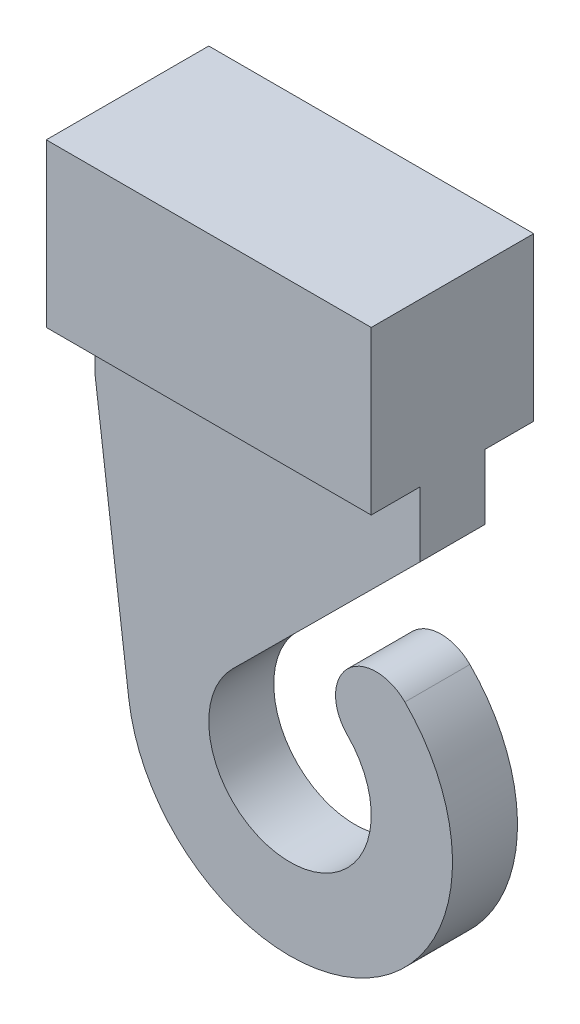
ISO-10303-21;
HEADER;
FILE_DESCRIPTION(('STEP AP214'),'2;1');
FILE_NAME('part.step','',(''),(''),'','','');
FILE_SCHEMA(('AUTOMOTIVE_DESIGN { 1 0 10303 214 1 1 1 1 }'));
ENDSEC;
DATA;
#1=APPLICATION_CONTEXT('core data for automotive mechanical design processes');
#2=APPLICATION_PROTOCOL_DEFINITION('international standard','automotive_design',2000,#1);
#3=PRODUCT_CONTEXT('',#1,'mechanical');
#4=PRODUCT('Part','Part','',(#3));
#5=PRODUCT_RELATED_PRODUCT_CATEGORY('part','',(#4));
#6=PRODUCT_DEFINITION_FORMATION('','',#4);
#7=PRODUCT_DEFINITION_CONTEXT('part definition',#1,'design');
#8=PRODUCT_DEFINITION('design','',#6,#7);
#9=PRODUCT_DEFINITION_SHAPE('','',#8);
#10=(LENGTH_UNIT() NAMED_UNIT(*) SI_UNIT(.MILLI.,.METRE.));
#11=(NAMED_UNIT(*) PLANE_ANGLE_UNIT() SI_UNIT($,.RADIAN.));
#12=(NAMED_UNIT(*) SI_UNIT($,.STERADIAN.) SOLID_ANGLE_UNIT());
#13=UNCERTAINTY_MEASURE_WITH_UNIT(LENGTH_MEASURE(1.E-05),#10,'distance_accuracy_value','');
#14=(GEOMETRIC_REPRESENTATION_CONTEXT(3) GLOBAL_UNCERTAINTY_ASSIGNED_CONTEXT((#13)) GLOBAL_UNIT_ASSIGNED_CONTEXT((#10,
#11,#12)) REPRESENTATION_CONTEXT('',''));
#15=CARTESIAN_POINT('',(0.,0.,0.));
#16=DIRECTION('',(0.,0.,1.));
#17=DIRECTION('',(1.,0.,0.));
#18=AXIS2_PLACEMENT_3D('',#15,#16,#17);
#19=CARTESIAN_POINT('',(8.,-2.5,2.5));
#20=DIRECTION('',(0.,1.,0.));
#21=DIRECTION('',(0.,0.,1.));
#22=AXIS2_PLACEMENT_3D('',#19,#20,#21);
#23=PLANE('',#22);
#24=DIRECTION('',(1.,0.,0.));
#25=VECTOR('',#24,1.);
#26=CARTESIAN_POINT('',(0.,-2.5,-1.));
#27=LINE('',#26,#25);
#28=CARTESIAN_POINT('',(0.,-2.5,-1.));
#29=VERTEX_POINT('',#28);
#30=CARTESIAN_POINT('',(10.,-2.5,-1.));
#31=VERTEX_POINT('',#30);
#32=EDGE_CURVE('E207',#29,#31,#27,.T.);
#33=ORIENTED_EDGE('',*,*,#32,.F.);
#34=DIRECTION('',(0.,0.,-1.));
#35=VECTOR('',#34,1.);
#36=CARTESIAN_POINT('',(0.,-2.5,2.5));
#37=LINE('',#36,#35);
#38=CARTESIAN_POINT('',(0.,-2.5,-2.5));
#39=VERTEX_POINT('',#38);
#40=EDGE_CURVE('E276',#29,#39,#37,.T.);
#41=ORIENTED_EDGE('',*,*,#40,.T.);
#42=DIRECTION('',(-1.,0.,0.));
#43=VECTOR('',#42,1.);
#44=CARTESIAN_POINT('',(8.,-2.5,-2.5));
#45=LINE('',#44,#43);
#46=CARTESIAN_POINT('',(10.,-2.5,-2.5));
#47=VERTEX_POINT('',#46);
#48=EDGE_CURVE('E279',#47,#39,#45,.T.);
#49=ORIENTED_EDGE('',*,*,#48,.F.);
#50=DIRECTION('',(0.,0.,-1.));
#51=VECTOR('',#50,1.);
#52=CARTESIAN_POINT('',(10.,-2.5,2.5));
#53=LINE('',#52,#51);
#54=EDGE_CURVE('E55',#31,#47,#53,.T.);
#55=ORIENTED_EDGE('',*,*,#54,.F.);
#56=EDGE_LOOP('',(#33,#41,#49,#55));
#57=FACE_BOUND('',#56,.T.);
#58=ADVANCED_FACE('F40',(#57),#23,.F.);
#59=DIRECTION('',(-1.,0.,0.));
#60=VECTOR('',#59,1.);
#61=CARTESIAN_POINT('',(0.,-2.5,0.999999999999998));
#62=LINE('',#61,#60);
#63=CARTESIAN_POINT('',(10.,-2.5,0.999999999999998));
#64=VERTEX_POINT('',#63);
#65=CARTESIAN_POINT('',(0.,-2.5,0.999999999999998));
#66=VERTEX_POINT('',#65);
#67=EDGE_CURVE('E63',#64,#66,#62,.T.);
#68=ORIENTED_EDGE('',*,*,#67,.F.);
#69=CARTESIAN_POINT('',(10.,-2.5,2.5));
#70=VERTEX_POINT('',#69);
#71=EDGE_CURVE('E224',#70,#64,#53,.T.);
#72=ORIENTED_EDGE('',*,*,#71,.F.);
#73=DIRECTION('',(-1.,0.,0.));
#74=VECTOR('',#73,1.);
#75=CARTESIAN_POINT('',(8.,-2.5,2.5));
#76=LINE('',#75,#74);
#77=CARTESIAN_POINT('',(0.,-2.5,2.5));
#78=VERTEX_POINT('',#77);
#79=EDGE_CURVE('E282',#70,#78,#76,.T.);
#80=ORIENTED_EDGE('',*,*,#79,.T.);
#81=EDGE_CURVE('E277',#78,#66,#37,.T.);
#82=ORIENTED_EDGE('',*,*,#81,.T.);
#83=EDGE_LOOP('',(#68,#72,#80,#82));
#84=FACE_BOUND('',#83,.T.);
#85=ADVANCED_FACE('F297',(#84),#23,.F.);
#86=CARTESIAN_POINT('',(0.,0.,0.));
#87=DIRECTION('',(1.,0.,0.));
#88=DIRECTION('',(0.,0.,-1.));
#89=AXIS2_PLACEMENT_3D('',#86,#87,#88);
#90=PLANE('',#89);
#91=DIRECTION('',(0.,1.,0.));
#92=VECTOR('',#91,1.);
#93=CARTESIAN_POINT('',(0.,2.5,-2.5));
#94=LINE('',#93,#92);
#95=CARTESIAN_POINT('',(0.,2.5,-2.5));
#96=VERTEX_POINT('',#95);
#97=EDGE_CURVE('E269',#39,#96,#94,.T.);
#98=ORIENTED_EDGE('',*,*,#97,.F.);
#99=ORIENTED_EDGE('',*,*,#40,.F.);
#100=DIRECTION('',(0.,1.,0.));
#101=VECTOR('',#100,1.);
#102=CARTESIAN_POINT('',(0.,-4.5,-1.));
#103=LINE('',#102,#101);
#104=CARTESIAN_POINT('',(0.,-4.5,-1.));
#105=VERTEX_POINT('',#104);
#106=EDGE_CURVE('E215',#105,#29,#103,.T.);
#107=ORIENTED_EDGE('',*,*,#106,.F.);
#108=DIRECTION('',(0.,0.,-1.));
#109=VECTOR('',#108,1.);
#110=CARTESIAN_POINT('',(0.,-4.5,0.999999999999998));
#111=LINE('',#110,#109);
#112=CARTESIAN_POINT('',(0.,-4.5,0.999999999999998));
#113=VERTEX_POINT('',#112);
#114=EDGE_CURVE('E206',#113,#105,#111,.T.);
#115=ORIENTED_EDGE('',*,*,#114,.F.);
#116=DIRECTION('',(0.,1.,0.));
#117=VECTOR('',#116,1.);
#118=CARTESIAN_POINT('',(0.,-4.5,0.999999999999998));
#119=LINE('',#118,#117);
#120=EDGE_CURVE('E218',#113,#66,#119,.T.);
#121=ORIENTED_EDGE('',*,*,#120,.T.);
#122=ORIENTED_EDGE('',*,*,#81,.F.);
#123=DIRECTION('',(0.,-1.,0.));
#124=VECTOR('',#123,1.);
#125=CARTESIAN_POINT('',(0.,2.5,2.5));
#126=LINE('',#125,#124);
#127=CARTESIAN_POINT('',(0.,2.5,2.5));
#128=VERTEX_POINT('',#127);
#129=EDGE_CURVE('E274',#128,#78,#126,.T.);
#130=ORIENTED_EDGE('',*,*,#129,.F.);
#131=DIRECTION('',(0.,0.,1.));
#132=VECTOR('',#131,1.);
#133=CARTESIAN_POINT('',(0.,2.5,2.5));
#134=LINE('',#133,#132);
#135=EDGE_CURVE('E272',#96,#128,#134,.T.);
#136=ORIENTED_EDGE('',*,*,#135,.F.);
#137=EDGE_LOOP('',(#98,#99,#107,#115,#121,#122,#130,#136));
#138=FACE_BOUND('',#137,.T.);
#139=DIRECTION('',(0.,1.,0.));
#140=VECTOR('',#139,1.);
#141=CARTESIAN_POINT('',(0.,1.5,-1.5));
#142=LINE('',#141,#140);
#143=CARTESIAN_POINT('',(0.,-1.5,-1.5));
#144=VERTEX_POINT('',#143);
#145=CARTESIAN_POINT('',(0.,1.5,-1.5));
#146=VERTEX_POINT('',#145);
#147=EDGE_CURVE('E235',#144,#146,#142,.T.);
#148=ORIENTED_EDGE('',*,*,#147,.T.);
#149=DIRECTION('',(0.,0.,1.));
#150=VECTOR('',#149,1.);
#151=CARTESIAN_POINT('',(0.,1.5,1.5));
#152=LINE('',#151,#150);
#153=CARTESIAN_POINT('',(0.,1.5,1.5));
#154=VERTEX_POINT('',#153);
#155=EDGE_CURVE('E252',#146,#154,#152,.T.);
#156=ORIENTED_EDGE('',*,*,#155,.T.);
#157=DIRECTION('',(0.,-1.,0.));
#158=VECTOR('',#157,1.);
#159=CARTESIAN_POINT('',(0.,1.5,1.5));
#160=LINE('',#159,#158);
#161=CARTESIAN_POINT('',(0.,-1.5,1.5));
#162=VERTEX_POINT('',#161);
#163=EDGE_CURVE('E255',#154,#162,#160,.T.);
#164=ORIENTED_EDGE('',*,*,#163,.T.);
#165=DIRECTION('',(0.,0.,-1.));
#166=VECTOR('',#165,1.);
#167=CARTESIAN_POINT('',(0.,-1.5,1.5));
#168=LINE('',#167,#166);
#169=EDGE_CURVE('E240',#162,#144,#168,.T.);
#170=ORIENTED_EDGE('',*,*,#169,.T.);
#171=EDGE_LOOP('',(#148,#156,#164,#170));
#172=FACE_BOUND('',#171,.T.);
#173=ADVANCED_FACE('F294',(#138,#172),#90,.F.);
#174=CARTESIAN_POINT('',(8.,2.5,-2.5));
#175=DIRECTION('',(0.,0.,1.));
#176=DIRECTION('',(0.,-1.,0.));
#177=AXIS2_PLACEMENT_3D('',#174,#175,#176);
#178=PLANE('',#177);
#179=ORIENTED_EDGE('',*,*,#97,.T.);
#180=DIRECTION('',(-1.,0.,0.));
#181=VECTOR('',#180,1.);
#182=CARTESIAN_POINT('',(8.,2.5,-2.5));
#183=LINE('',#182,#181);
#184=CARTESIAN_POINT('',(10.,2.5,-2.5));
#185=VERTEX_POINT('',#184);
#186=EDGE_CURVE('E11',#185,#96,#183,.T.);
#187=ORIENTED_EDGE('',*,*,#186,.F.);
#188=DIRECTION('',(0.,1.,0.));
#189=VECTOR('',#188,1.);
#190=CARTESIAN_POINT('',(10.,-2.5,-2.5));
#191=LINE('',#190,#189);
#192=EDGE_CURVE('E226',#47,#185,#191,.T.);
#193=ORIENTED_EDGE('',*,*,#192,.F.);
#194=ORIENTED_EDGE('',*,*,#48,.T.);
#195=EDGE_LOOP('',(#179,#187,#193,#194));
#196=FACE_BOUND('',#195,.T.);
#197=ADVANCED_FACE('F42',(#196),#178,.F.);
#198=CARTESIAN_POINT('',(8.,2.5,2.5));
#199=DIRECTION('',(0.,-1.,0.));
#200=DIRECTION('',(0.,0.,-1.));
#201=AXIS2_PLACEMENT_3D('',#198,#199,#200);
#202=PLANE('',#201);
#203=ORIENTED_EDGE('',*,*,#135,.T.);
#204=DIRECTION('',(-1.,0.,0.));
#205=VECTOR('',#204,1.);
#206=CARTESIAN_POINT('',(8.,2.5,2.5));
#207=LINE('',#206,#205);
#208=CARTESIAN_POINT('',(10.,2.5,2.5));
#209=VERTEX_POINT('',#208);
#210=EDGE_CURVE('E48',#209,#128,#207,.T.);
#211=ORIENTED_EDGE('',*,*,#210,.F.);
#212=DIRECTION('',(0.,0.,1.));
#213=VECTOR('',#212,1.);
#214=CARTESIAN_POINT('',(10.,2.5,-2.5));
#215=LINE('',#214,#213);
#216=EDGE_CURVE('E229',#185,#209,#215,.T.);
#217=ORIENTED_EDGE('',*,*,#216,.F.);
#218=ORIENTED_EDGE('',*,*,#186,.T.);
#219=EDGE_LOOP('',(#203,#211,#217,#218));
#220=FACE_BOUND('',#219,.T.);
#221=ADVANCED_FACE('F315',(#220),#202,.F.);
#222=CARTESIAN_POINT('',(8.,2.5,2.5));
#223=DIRECTION('',(0.,0.,-1.));
#224=DIRECTION('',(0.,1.,0.));
#225=AXIS2_PLACEMENT_3D('',#222,#223,#224);
#226=PLANE('',#225);
#227=ORIENTED_EDGE('',*,*,#129,.T.);
#228=ORIENTED_EDGE('',*,*,#79,.F.);
#229=DIRECTION('',(0.,-1.,0.));
#230=VECTOR('',#229,1.);
#231=CARTESIAN_POINT('',(10.,2.5,2.5));
#232=LINE('',#231,#230);
#233=EDGE_CURVE('E232',#209,#70,#232,.T.);
#234=ORIENTED_EDGE('',*,*,#233,.F.);
#235=ORIENTED_EDGE('',*,*,#210,.T.);
#236=EDGE_LOOP('',(#227,#228,#234,#235));
#237=FACE_BOUND('',#236,.T.);
#238=ADVANCED_FACE('F288',(#237),#226,.F.);
#239=CARTESIAN_POINT('',(8.,1.5,-1.5));
#240=DIRECTION('',(0.,0.,1.));
#241=DIRECTION('',(0.,-1.,0.));
#242=AXIS2_PLACEMENT_3D('',#239,#240,#241);
#243=PLANE('',#242);
#244=ORIENTED_EDGE('',*,*,#147,.F.);
#245=DIRECTION('',(-1.,0.,0.));
#246=VECTOR('',#245,1.);
#247=CARTESIAN_POINT('',(8.,-1.5,-1.5));
#248=LINE('',#247,#246);
#249=CARTESIAN_POINT('',(8.,-1.5,-1.5));
#250=VERTEX_POINT('',#249);
#251=EDGE_CURVE('E249',#250,#144,#248,.T.);
#252=ORIENTED_EDGE('',*,*,#251,.F.);
#253=DIRECTION('',(0.,1.,0.));
#254=VECTOR('',#253,1.);
#255=CARTESIAN_POINT('',(8.,1.5,-1.5));
#256=LINE('',#255,#254);
#257=CARTESIAN_POINT('',(8.,1.5,-1.5));
#258=VERTEX_POINT('',#257);
#259=EDGE_CURVE('E236',#250,#258,#256,.T.);
#260=ORIENTED_EDGE('',*,*,#259,.T.);
#261=DIRECTION('',(-1.,0.,0.));
#262=VECTOR('',#261,1.);
#263=CARTESIAN_POINT('',(8.,1.5,-1.5));
#264=LINE('',#263,#262);
#265=EDGE_CURVE('E266',#258,#146,#264,.T.);
#266=ORIENTED_EDGE('',*,*,#265,.T.);
#267=EDGE_LOOP('',(#244,#252,#260,#266));
#268=FACE_BOUND('',#267,.T.);
#269=ADVANCED_FACE('F321',(#268),#243,.T.);
#270=CARTESIAN_POINT('',(8.,1.5,1.5));
#271=DIRECTION('',(0.,-1.,0.));
#272=DIRECTION('',(0.,0.,-1.));
#273=AXIS2_PLACEMENT_3D('',#270,#271,#272);
#274=PLANE('',#273);
#275=ORIENTED_EDGE('',*,*,#155,.F.);
#276=ORIENTED_EDGE('',*,*,#265,.F.);
#277=DIRECTION('',(0.,0.,1.));
#278=VECTOR('',#277,1.);
#279=CARTESIAN_POINT('',(8.,1.5,1.5));
#280=LINE('',#279,#278);
#281=CARTESIAN_POINT('',(8.,1.5,1.5));
#282=VERTEX_POINT('',#281);
#283=EDGE_CURVE('E239',#258,#282,#280,.T.);
#284=ORIENTED_EDGE('',*,*,#283,.T.);
#285=DIRECTION('',(-1.,0.,0.));
#286=VECTOR('',#285,1.);
#287=CARTESIAN_POINT('',(8.,1.5,1.5));
#288=LINE('',#287,#286);
#289=EDGE_CURVE('E264',#282,#154,#288,.T.);
#290=ORIENTED_EDGE('',*,*,#289,.T.);
#291=EDGE_LOOP('',(#275,#276,#284,#290));
#292=FACE_BOUND('',#291,.T.);
#293=ADVANCED_FACE('F333',(#292),#274,.T.);
#294=CARTESIAN_POINT('',(8.,1.5,1.5));
#295=DIRECTION('',(0.,0.,-1.));
#296=DIRECTION('',(0.,1.,0.));
#297=AXIS2_PLACEMENT_3D('',#294,#295,#296);
#298=PLANE('',#297);
#299=ORIENTED_EDGE('',*,*,#163,.F.);
#300=ORIENTED_EDGE('',*,*,#289,.F.);
#301=DIRECTION('',(0.,-1.,0.));
#302=VECTOR('',#301,1.);
#303=CARTESIAN_POINT('',(8.,1.5,1.5));
#304=LINE('',#303,#302);
#305=CARTESIAN_POINT('',(8.,-1.5,1.5));
#306=VERTEX_POINT('',#305);
#307=EDGE_CURVE('E243',#282,#306,#304,.T.);
#308=ORIENTED_EDGE('',*,*,#307,.T.);
#309=DIRECTION('',(-1.,0.,0.));
#310=VECTOR('',#309,1.);
#311=CARTESIAN_POINT('',(8.,-1.5,1.5));
#312=LINE('',#311,#310);
#313=EDGE_CURVE('E262',#306,#162,#312,.T.);
#314=ORIENTED_EDGE('',*,*,#313,.T.);
#315=EDGE_LOOP('',(#299,#300,#308,#314));
#316=FACE_BOUND('',#315,.T.);
#317=ADVANCED_FACE('F337',(#316),#298,.T.);
#318=CARTESIAN_POINT('',(8.,-1.5,1.5));
#319=DIRECTION('',(0.,1.,0.));
#320=DIRECTION('',(0.,0.,1.));
#321=AXIS2_PLACEMENT_3D('',#318,#319,#320);
#322=PLANE('',#321);
#323=ORIENTED_EDGE('',*,*,#169,.F.);
#324=ORIENTED_EDGE('',*,*,#313,.F.);
#325=DIRECTION('',(0.,0.,-1.));
#326=VECTOR('',#325,1.);
#327=CARTESIAN_POINT('',(8.,-1.5,1.5));
#328=LINE('',#327,#326);
#329=EDGE_CURVE('E246',#306,#250,#328,.T.);
#330=ORIENTED_EDGE('',*,*,#329,.T.);
#331=ORIENTED_EDGE('',*,*,#251,.T.);
#332=EDGE_LOOP('',(#323,#324,#330,#331));
#333=FACE_BOUND('',#332,.T.);
#334=ADVANCED_FACE('F341',(#333),#322,.T.);
#335=CARTESIAN_POINT('',(8.,0.,0.));
#336=DIRECTION('',(1.,0.,0.));
#337=DIRECTION('',(0.,0.,-1.));
#338=AXIS2_PLACEMENT_3D('',#335,#336,#337);
#339=PLANE('',#338);
#340=ORIENTED_EDGE('',*,*,#283,.F.);
#341=ORIENTED_EDGE('',*,*,#259,.F.);
#342=ORIENTED_EDGE('',*,*,#329,.F.);
#343=ORIENTED_EDGE('',*,*,#307,.F.);
#344=EDGE_LOOP('',(#340,#341,#342,#343));
#345=FACE_BOUND('',#344,.T.);
#346=ADVANCED_FACE('F345',(#345),#339,.F.);
#347=CARTESIAN_POINT('',(10.,0.,0.));
#348=DIRECTION('',(1.,0.,0.));
#349=DIRECTION('',(0.,0.,-1.));
#350=AXIS2_PLACEMENT_3D('',#347,#348,#349);
#351=PLANE('',#350);
#352=ORIENTED_EDGE('',*,*,#71,.T.);
#353=DIRECTION('',(0.,1.,0.));
#354=VECTOR('',#353,1.);
#355=CARTESIAN_POINT('',(10.,-4.5,0.999999999999998));
#356=LINE('',#355,#354);
#357=CARTESIAN_POINT('',(10.,-4.5,0.999999999999998));
#358=VERTEX_POINT('',#357);
#359=EDGE_CURVE('E221',#358,#64,#356,.T.);
#360=ORIENTED_EDGE('',*,*,#359,.F.);
#361=DIRECTION('',(0.,0.,1.));
#362=VECTOR('',#361,1.);
#363=CARTESIAN_POINT('',(10.,-4.5,0.999999999999998));
#364=LINE('',#363,#362);
#365=CARTESIAN_POINT('',(10.,-4.5,-1.));
#366=VERTEX_POINT('',#365);
#367=EDGE_CURVE('E203',#366,#358,#364,.T.);
#368=ORIENTED_EDGE('',*,*,#367,.F.);
#369=DIRECTION('',(0.,1.,0.));
#370=VECTOR('',#369,1.);
#371=CARTESIAN_POINT('',(10.,-4.5,-1.));
#372=LINE('',#371,#370);
#373=EDGE_CURVE('E210',#366,#31,#372,.T.);
#374=ORIENTED_EDGE('',*,*,#373,.T.);
#375=ORIENTED_EDGE('',*,*,#54,.T.);
#376=ORIENTED_EDGE('',*,*,#192,.T.);
#377=ORIENTED_EDGE('',*,*,#216,.T.);
#378=ORIENTED_EDGE('',*,*,#233,.T.);
#379=EDGE_LOOP('',(#352,#360,#368,#374,#375,#376,#377,#378));
#380=FACE_BOUND('',#379,.T.);
#381=ADVANCED_FACE('F302',(#380),#351,.T.);
#382=CARTESIAN_POINT('',(0.,-4.5,0.999999999999998));
#383=DIRECTION('',(0.,0.,-1.));
#384=DIRECTION('',(-1.,0.,0.));
#385=AXIS2_PLACEMENT_3D('',#382,#383,#384);
#386=PLANE('',#385);
#387=ORIENTED_EDGE('',*,*,#67,.T.);
#388=ORIENTED_EDGE('',*,*,#120,.F.);
#389=DIRECTION('',(0.126868925751438,-0.991919490522631,0.));
#390=VECTOR('',#389,1.);
#391=CARTESIAN_POINT('',(-0.566296920875342,-0.072430759445958,0.999999999999998));
#392=LINE('',#391,#390);
#393=CARTESIAN_POINT('',(1.04040254738685,-12.6343446287572,0.999999999999998));
#394=VERTEX_POINT('',#393);
#395=EDGE_CURVE('E184',#113,#394,#392,.T.);
#396=ORIENTED_EDGE('',*,*,#395,.T.);
#397=CARTESIAN_POINT('',(6.,-12.,0.999999999999998));
#398=DIRECTION('',(0.,0.,1.));
#399=DIRECTION('',(1.,0.,0.));
#400=AXIS2_PLACEMENT_3D('',#397,#398,#399);
#401=CIRCLE('',#400,5.);
#402=CARTESIAN_POINT('',(9.53553390593273,-8.46446609406726,0.999999999999998));
#403=VERTEX_POINT('',#402);
#404=EDGE_CURVE('E181',#394,#403,#401,.T.);
#405=ORIENTED_EDGE('',*,*,#404,.T.);
#406=CARTESIAN_POINT('',(8.65165042944955,-9.34834957055044,0.999999999999998));
#407=DIRECTION('',(0.,0.,1.));
#408=DIRECTION('',(1.,0.,0.));
#409=AXIS2_PLACEMENT_3D('',#406,#407,#408);
#410=CIRCLE('',#409,1.25);
#411=CARTESIAN_POINT('',(7.76776695296637,-10.2322330470336,0.999999999999998));
#412=VERTEX_POINT('',#411);
#413=EDGE_CURVE('E192',#403,#412,#410,.T.);
#414=ORIENTED_EDGE('',*,*,#413,.T.);
#415=CARTESIAN_POINT('',(6.,-12.,0.999999999999998));
#416=DIRECTION('',(0.,0.,1.));
#417=DIRECTION('',(1.,0.,0.));
#418=AXIS2_PLACEMENT_3D('',#415,#416,#417);
#419=CIRCLE('',#418,2.5);
#420=CARTESIAN_POINT('',(4.23770629637475,-10.2267766913999,0.999999999999998));
#421=VERTEX_POINT('',#420);
#422=EDGE_CURVE('E172',#421,#412,#419,.T.);
#423=ORIENTED_EDGE('',*,*,#422,.F.);
#424=DIRECTION('',(-0.709289323440053,-0.7049174814501,0.));
#425=VECTOR('',#424,1.);
#426=CARTESIAN_POINT('',(7.21904355228415,-7.26381548454529,0.999999999999998));
#427=LINE('',#426,#425);
#428=EDGE_CURVE('E195',#358,#421,#427,.T.);
#429=ORIENTED_EDGE('',*,*,#428,.F.);
#430=ORIENTED_EDGE('',*,*,#359,.T.);
#431=EDGE_LOOP('',(#387,#388,#396,#405,#414,#423,#429,#430));
#432=FACE_BOUND('',#431,.T.);
#433=ADVANCED_FACE('F299',(#432),#386,.F.);
#434=CARTESIAN_POINT('',(0.,-4.5,-1.));
#435=DIRECTION('',(0.,0.,1.));
#436=DIRECTION('',(1.,0.,0.));
#437=AXIS2_PLACEMENT_3D('',#434,#435,#436);
#438=PLANE('',#437);
#439=ORIENTED_EDGE('',*,*,#32,.T.);
#440=ORIENTED_EDGE('',*,*,#373,.F.);
#441=DIRECTION('',(-0.709289323440053,-0.7049174814501,0.));
#442=VECTOR('',#441,1.);
#443=CARTESIAN_POINT('',(7.21904355228415,-7.26381548454529,-1.));
#444=LINE('',#443,#442);
#445=CARTESIAN_POINT('',(4.23770629637475,-10.2267766913999,-1.));
#446=VERTEX_POINT('',#445);
#447=EDGE_CURVE('E163',#366,#446,#444,.T.);
#448=ORIENTED_EDGE('',*,*,#447,.T.);
#449=CARTESIAN_POINT('',(6.,-12.,-1.));
#450=DIRECTION('',(0.,0.,1.));
#451=DIRECTION('',(1.,0.,0.));
#452=AXIS2_PLACEMENT_3D('',#449,#450,#451);
#453=CIRCLE('',#452,2.5);
#454=CARTESIAN_POINT('',(7.76776695296637,-10.2322330470336,-1.));
#455=VERTEX_POINT('',#454);
#456=EDGE_CURVE('E154',#446,#455,#453,.T.);
#457=ORIENTED_EDGE('',*,*,#456,.T.);
#458=CARTESIAN_POINT('',(8.65165042944955,-9.34834957055044,-1.));
#459=DIRECTION('',(0.,0.,1.));
#460=DIRECTION('',(1.,0.,0.));
#461=AXIS2_PLACEMENT_3D('',#458,#459,#460);
#462=CIRCLE('',#461,1.25);
#463=CARTESIAN_POINT('',(9.53553390593273,-8.46446609406726,-1.));
#464=VERTEX_POINT('',#463);
#465=EDGE_CURVE('E159',#464,#455,#462,.T.);
#466=ORIENTED_EDGE('',*,*,#465,.F.);
#467=CARTESIAN_POINT('',(6.,-12.,-1.));
#468=DIRECTION('',(0.,0.,1.));
#469=DIRECTION('',(1.,0.,0.));
#470=AXIS2_PLACEMENT_3D('',#467,#468,#469);
#471=CIRCLE('',#470,5.);
#472=CARTESIAN_POINT('',(1.04040254738685,-12.6343446287572,-1.));
#473=VERTEX_POINT('',#472);
#474=EDGE_CURVE('E177',#473,#464,#471,.T.);
#475=ORIENTED_EDGE('',*,*,#474,.F.);
#476=DIRECTION('',(0.126868925751438,-0.991919490522631,0.));
#477=VECTOR('',#476,1.);
#478=CARTESIAN_POINT('',(-0.566296920875342,-0.072430759445958,-1.));
#479=LINE('',#478,#477);
#480=EDGE_CURVE('E188',#105,#473,#479,.T.);
#481=ORIENTED_EDGE('',*,*,#480,.F.);
#482=ORIENTED_EDGE('',*,*,#106,.T.);
#483=EDGE_LOOP('',(#439,#440,#448,#457,#466,#475,#481,#482));
#484=FACE_BOUND('',#483,.T.);
#485=ADVANCED_FACE('F156',(#484),#438,.F.);
#486=CARTESIAN_POINT('',(8.65165042944955,-9.34834957055044,-1.));
#487=DIRECTION('',(0.,0.,1.));
#488=DIRECTION('',(1.,0.,0.));
#489=AXIS2_PLACEMENT_3D('',#486,#487,#488);
#490=CYLINDRICAL_SURFACE('',#489,1.25);
#491=ORIENTED_EDGE('',*,*,#413,.F.);
#492=DIRECTION('',(0.,0.,1.));
#493=VECTOR('',#492,1.);
#494=CARTESIAN_POINT('',(9.53553390593273,-8.46446609406726,-1.));
#495=LINE('',#494,#493);
#496=EDGE_CURVE('E180',#464,#403,#495,.T.);
#497=ORIENTED_EDGE('',*,*,#496,.F.);
#498=ORIENTED_EDGE('',*,*,#465,.T.);
#499=DIRECTION('',(0.,0.,1.));
#500=VECTOR('',#499,1.);
#501=CARTESIAN_POINT('',(7.76776695296637,-10.2322330470336,-1.));
#502=LINE('',#501,#500);
#503=EDGE_CURVE('E169',#455,#412,#502,.T.);
#504=ORIENTED_EDGE('',*,*,#503,.T.);
#505=EDGE_LOOP('',(#491,#497,#498,#504));
#506=FACE_BOUND('',#505,.T.);
#507=ADVANCED_FACE('F179',(#506),#490,.T.);
#508=CARTESIAN_POINT('',(6.,-12.,-1.));
#509=DIRECTION('',(0.,0.,1.));
#510=DIRECTION('',(1.,0.,0.));
#511=AXIS2_PLACEMENT_3D('',#508,#509,#510);
#512=CYLINDRICAL_SURFACE('',#511,5.);
#513=ORIENTED_EDGE('',*,*,#404,.F.);
#514=DIRECTION('',(0.,0.,1.));
#515=VECTOR('',#514,1.);
#516=CARTESIAN_POINT('',(1.04040254738685,-12.6343446287572,-1.));
#517=LINE('',#516,#515);
#518=EDGE_CURVE('E200',#473,#394,#517,.T.);
#519=ORIENTED_EDGE('',*,*,#518,.F.);
#520=ORIENTED_EDGE('',*,*,#474,.T.);
#521=ORIENTED_EDGE('',*,*,#496,.T.);
#522=EDGE_LOOP('',(#513,#519,#520,#521));
#523=FACE_BOUND('',#522,.T.);
#524=ADVANCED_FACE('F308',(#523),#512,.T.);
#525=CARTESIAN_POINT('',(-0.566296920875342,-0.072430759445958,-1.));
#526=DIRECTION('',(-0.991919490522631,-0.126868925751438,0.));
#527=DIRECTION('',(0.126868925751438,-0.991919490522631,0.));
#528=AXIS2_PLACEMENT_3D('',#525,#526,#527);
#529=PLANE('',#528);
#530=ORIENTED_EDGE('',*,*,#395,.F.);
#531=ORIENTED_EDGE('',*,*,#114,.T.);
#532=ORIENTED_EDGE('',*,*,#480,.T.);
#533=ORIENTED_EDGE('',*,*,#518,.T.);
#534=EDGE_LOOP('',(#530,#531,#532,#533));
#535=FACE_BOUND('',#534,.T.);
#536=ADVANCED_FACE('F311',(#535),#529,.T.);
#537=CARTESIAN_POINT('',(7.21904355228415,-7.26381548454529,-1.));
#538=DIRECTION('',(-0.7049174814501,0.709289323440053,0.));
#539=DIRECTION('',(-0.709289323440053,-0.7049174814501,0.));
#540=AXIS2_PLACEMENT_3D('',#537,#538,#539);
#541=PLANE('',#540);
#542=ORIENTED_EDGE('',*,*,#428,.T.);
#543=DIRECTION('',(0.,0.,1.));
#544=VECTOR('',#543,1.);
#545=CARTESIAN_POINT('',(4.23770629637475,-10.2267766913999,-1.));
#546=LINE('',#545,#544);
#547=EDGE_CURVE('E176',#446,#421,#546,.T.);
#548=ORIENTED_EDGE('',*,*,#547,.F.);
#549=ORIENTED_EDGE('',*,*,#447,.F.);
#550=ORIENTED_EDGE('',*,*,#367,.T.);
#551=EDGE_LOOP('',(#542,#548,#549,#550));
#552=FACE_BOUND('',#551,.T.);
#553=ADVANCED_FACE('F304',(#552),#541,.F.);
#554=CARTESIAN_POINT('',(6.,-12.,-1.));
#555=DIRECTION('',(0.,0.,1.));
#556=DIRECTION('',(1.,0.,0.));
#557=AXIS2_PLACEMENT_3D('',#554,#555,#556);
#558=CYLINDRICAL_SURFACE('',#557,2.5);
#559=ORIENTED_EDGE('',*,*,#422,.T.);
#560=ORIENTED_EDGE('',*,*,#503,.F.);
#561=ORIENTED_EDGE('',*,*,#456,.F.);
#562=ORIENTED_EDGE('',*,*,#547,.T.);
#563=EDGE_LOOP('',(#559,#560,#561,#562));
#564=FACE_BOUND('',#563,.T.);
#565=ADVANCED_FACE('F170',(#564),#558,.F.);
#566=CLOSED_SHELL('',(#58,#85,#173,#197,#221,#238,#269,#293,#317,#334,#346,#381,#433,#485,#507,
#524,#536,#553,#565));
#567=MANIFOLD_SOLID_BREP('B2',#566);
#568=ADVANCED_BREP_SHAPE_REPRESENTATION('',(#18,#567),#14);
#569=SHAPE_DEFINITION_REPRESENTATION(#9,#568);
ENDSEC;
END-ISO-10303-21;
